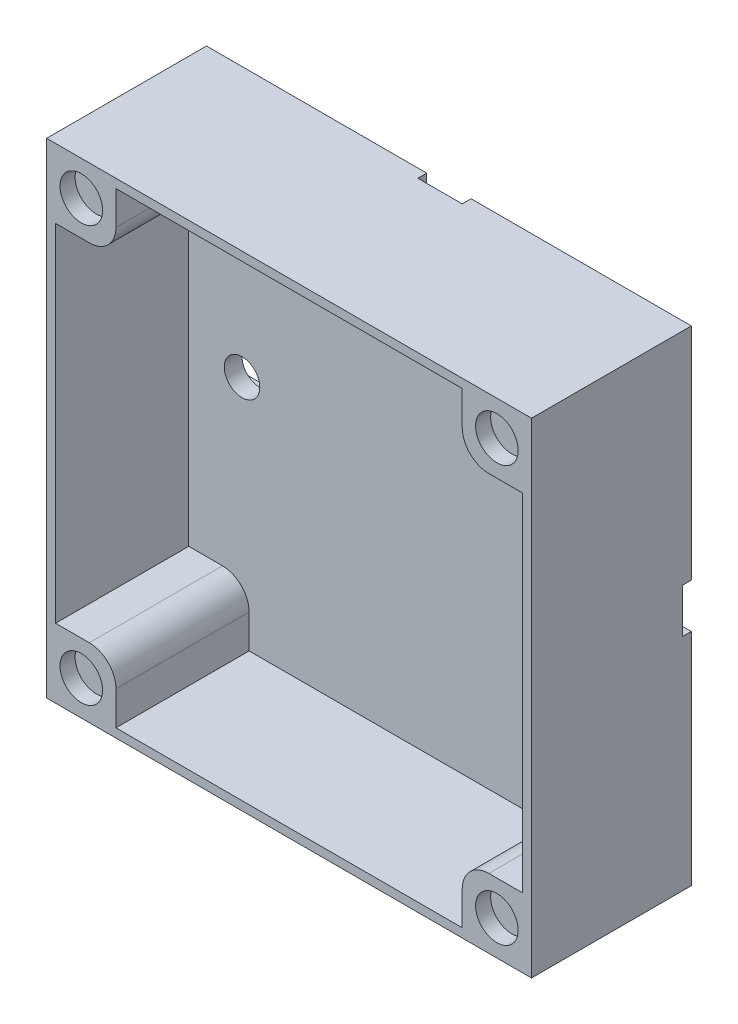
ISO-10303-21;
HEADER;
FILE_DESCRIPTION(('STEP AP214'),'2;1');
FILE_NAME('part.step','',(''),(''),'','','');
FILE_SCHEMA(('AUTOMOTIVE_DESIGN { 1 0 10303 214 1 1 1 1 }'));
ENDSEC;
DATA;
#1=APPLICATION_CONTEXT('core data for automotive mechanical design processes');
#2=APPLICATION_PROTOCOL_DEFINITION('international standard','automotive_design',2000,#1);
#3=PRODUCT_CONTEXT('',#1,'mechanical');
#4=PRODUCT('Part','Part','',(#3));
#5=PRODUCT_RELATED_PRODUCT_CATEGORY('part','',(#4));
#6=PRODUCT_DEFINITION_FORMATION('','',#4);
#7=PRODUCT_DEFINITION_CONTEXT('part definition',#1,'design');
#8=PRODUCT_DEFINITION('design','',#6,#7);
#9=PRODUCT_DEFINITION_SHAPE('','',#8);
#10=(LENGTH_UNIT() NAMED_UNIT(*) SI_UNIT(.MILLI.,.METRE.));
#11=(NAMED_UNIT(*) PLANE_ANGLE_UNIT() SI_UNIT($,.RADIAN.));
#12=(NAMED_UNIT(*) SI_UNIT($,.STERADIAN.) SOLID_ANGLE_UNIT());
#13=UNCERTAINTY_MEASURE_WITH_UNIT(LENGTH_MEASURE(1.E-05),#10,'distance_accuracy_value','');
#14=(GEOMETRIC_REPRESENTATION_CONTEXT(3) GLOBAL_UNCERTAINTY_ASSIGNED_CONTEXT((#13)) GLOBAL_UNIT_ASSIGNED_CONTEXT((#10,
#11,#12)) REPRESENTATION_CONTEXT('',''));
#15=CARTESIAN_POINT('',(0.,0.,0.));
#16=DIRECTION('',(0.,0.,1.));
#17=DIRECTION('',(1.,0.,0.));
#18=AXIS2_PLACEMENT_3D('',#15,#16,#17);
#19=CARTESIAN_POINT('',(27.3,27.3,3.));
#20=DIRECTION('',(0.,-1.,0.));
#21=DIRECTION('',(1.,0.,0.));
#22=AXIS2_PLACEMENT_3D('',#19,#20,#21);
#23=PLANE('',#22);
#24=DIRECTION('',(-1.,0.,0.));
#25=VECTOR('',#24,1.);
#26=CARTESIAN_POINT('',(27.3,27.3,0.));
#27=LINE('',#26,#25);
#28=CARTESIAN_POINT('',(-2.5,27.3,0.));
#29=VERTEX_POINT('',#28);
#30=CARTESIAN_POINT('',(-27.3,27.3,0.));
#31=VERTEX_POINT('',#30);
#32=EDGE_CURVE('E416',#29,#31,#27,.T.);
#33=ORIENTED_EDGE('',*,*,#32,.T.);
#34=DIRECTION('',(0.,0.,-1.));
#35=VECTOR('',#34,1.);
#36=CARTESIAN_POINT('',(-27.3,27.3,3.));
#37=LINE('',#36,#35);
#38=CARTESIAN_POINT('',(-27.3,27.3,18.));
#39=VERTEX_POINT('',#38);
#40=EDGE_CURVE('E429',#39,#31,#37,.T.);
#41=ORIENTED_EDGE('',*,*,#40,.F.);
#42=DIRECTION('',(-1.,0.,0.));
#43=VECTOR('',#42,1.);
#44=CARTESIAN_POINT('',(0.,27.3,18.));
#45=LINE('',#44,#43);
#46=CARTESIAN_POINT('',(27.3,27.3,18.));
#47=VERTEX_POINT('',#46);
#48=EDGE_CURVE('E341',#47,#39,#45,.T.);
#49=ORIENTED_EDGE('',*,*,#48,.F.);
#50=DIRECTION('',(0.,0.,-1.));
#51=VECTOR('',#50,1.);
#52=CARTESIAN_POINT('',(27.3,27.3,3.));
#53=LINE('',#52,#51);
#54=CARTESIAN_POINT('',(27.3,27.3,0.));
#55=VERTEX_POINT('',#54);
#56=EDGE_CURVE('E427',#47,#55,#53,.T.);
#57=ORIENTED_EDGE('',*,*,#56,.T.);
#58=CARTESIAN_POINT('',(2.5,27.3,0.));
#59=VERTEX_POINT('',#58);
#60=EDGE_CURVE('E417',#55,#59,#27,.T.);
#61=ORIENTED_EDGE('',*,*,#60,.T.);
#62=DIRECTION('',(0.,0.,-1.));
#63=VECTOR('',#62,1.);
#64=CARTESIAN_POINT('',(2.5,27.3,1.));
#65=LINE('',#64,#63);
#66=CARTESIAN_POINT('',(2.5,27.3,1.));
#67=VERTEX_POINT('',#66);
#68=EDGE_CURVE('E375',#67,#59,#65,.T.);
#69=ORIENTED_EDGE('',*,*,#68,.F.);
#70=DIRECTION('',(1.,0.,0.));
#71=VECTOR('',#70,1.);
#72=CARTESIAN_POINT('',(-2.5,27.3,1.));
#73=LINE('',#72,#71);
#74=CARTESIAN_POINT('',(-2.5,27.3,1.));
#75=VERTEX_POINT('',#74);
#76=EDGE_CURVE('E392',#75,#67,#73,.T.);
#77=ORIENTED_EDGE('',*,*,#76,.F.);
#78=DIRECTION('',(0.,0.,-1.));
#79=VECTOR('',#78,1.);
#80=CARTESIAN_POINT('',(-2.5,27.3,1.));
#81=LINE('',#80,#79);
#82=EDGE_CURVE('E399',#75,#29,#81,.T.);
#83=ORIENTED_EDGE('',*,*,#82,.T.);
#84=EDGE_LOOP('',(#33,#41,#49,#57,#61,#69,#77,#83));
#85=FACE_BOUND('',#84,.T.);
#86=ADVANCED_FACE('F71',(#85),#23,.F.);
#87=CARTESIAN_POINT('',(0.,0.,0.));
#88=DIRECTION('',(0.,0.,1.));
#89=DIRECTION('',(1.,0.,0.));
#90=AXIS2_PLACEMENT_3D('',#87,#88,#89);
#91=PLANE('',#90);
#92=DIRECTION('',(-1.,0.,0.));
#93=VECTOR('',#92,1.);
#94=CARTESIAN_POINT('',(27.3,2.5,0.));
#95=LINE('',#94,#93);
#96=CARTESIAN_POINT('',(-2.5,2.5,0.));
#97=VERTEX_POINT('',#96);
#98=CARTESIAN_POINT('',(-27.3,2.5,0.));
#99=VERTEX_POINT('',#98);
#100=EDGE_CURVE('E374',#97,#99,#95,.T.);
#101=ORIENTED_EDGE('',*,*,#100,.T.);
#102=DIRECTION('',(0.,-1.,0.));
#103=VECTOR('',#102,1.);
#104=CARTESIAN_POINT('',(-27.3,27.3,0.));
#105=LINE('',#104,#103);
#106=EDGE_CURVE('E414',#31,#99,#105,.T.);
#107=ORIENTED_EDGE('',*,*,#106,.F.);
#108=ORIENTED_EDGE('',*,*,#32,.F.);
#109=DIRECTION('',(0.,-1.,0.));
#110=VECTOR('',#109,1.);
#111=CARTESIAN_POINT('',(-2.5,27.3,0.));
#112=LINE('',#111,#110);
#113=EDGE_CURVE('E393',#29,#97,#112,.T.);
#114=ORIENTED_EDGE('',*,*,#113,.T.);
#115=EDGE_LOOP('',(#101,#107,#108,#114));
#116=FACE_BOUND('',#115,.T.);
#117=ADVANCED_FACE('F553',(#116),#91,.F.);
#118=DIRECTION('',(0.,-1.,0.));
#119=VECTOR('',#118,1.);
#120=CARTESIAN_POINT('',(2.5,27.3,0.));
#121=LINE('',#120,#119);
#122=CARTESIAN_POINT('',(2.5,2.5,0.));
#123=VERTEX_POINT('',#122);
#124=EDGE_CURVE('E346',#59,#123,#121,.T.);
#125=ORIENTED_EDGE('',*,*,#124,.F.);
#126=ORIENTED_EDGE('',*,*,#60,.F.);
#127=DIRECTION('',(0.,-1.,0.));
#128=VECTOR('',#127,1.);
#129=CARTESIAN_POINT('',(27.3,27.3,0.));
#130=LINE('',#129,#128);
#131=CARTESIAN_POINT('',(27.3,2.5,0.));
#132=VERTEX_POINT('',#131);
#133=EDGE_CURVE('E420',#55,#132,#130,.T.);
#134=ORIENTED_EDGE('',*,*,#133,.T.);
#135=EDGE_CURVE('E361',#132,#123,#95,.T.);
#136=ORIENTED_EDGE('',*,*,#135,.T.);
#137=EDGE_LOOP('',(#125,#126,#134,#136));
#138=FACE_BOUND('',#137,.T.);
#139=ADVANCED_FACE('F559',(#138),#91,.F.);
#140=CARTESIAN_POINT('',(27.3,-27.3,3.));
#141=DIRECTION('',(0.,-1.,0.));
#142=DIRECTION('',(1.,0.,0.));
#143=AXIS2_PLACEMENT_3D('',#140,#141,#142);
#144=PLANE('',#143);
#145=DIRECTION('',(0.,0.,-1.));
#146=VECTOR('',#145,1.);
#147=CARTESIAN_POINT('',(27.3,-27.3,3.));
#148=LINE('',#147,#146);
#149=CARTESIAN_POINT('',(27.3,-27.3,18.));
#150=VERTEX_POINT('',#149);
#151=CARTESIAN_POINT('',(27.3,-27.3,0.));
#152=VERTEX_POINT('',#151);
#153=EDGE_CURVE('E423',#150,#152,#148,.T.);
#154=ORIENTED_EDGE('',*,*,#153,.F.);
#155=DIRECTION('',(1.,0.,0.));
#156=VECTOR('',#155,1.);
#157=CARTESIAN_POINT('',(0.,-27.3,18.));
#158=LINE('',#157,#156);
#159=CARTESIAN_POINT('',(-27.3,-27.3,18.));
#160=VERTEX_POINT('',#159);
#161=EDGE_CURVE('E337',#160,#150,#158,.T.);
#162=ORIENTED_EDGE('',*,*,#161,.F.);
#163=DIRECTION('',(0.,0.,-1.));
#164=VECTOR('',#163,1.);
#165=CARTESIAN_POINT('',(-27.3,-27.3,3.));
#166=LINE('',#165,#164);
#167=CARTESIAN_POINT('',(-27.3,-27.3,0.));
#168=VERTEX_POINT('',#167);
#169=EDGE_CURVE('E422',#160,#168,#166,.T.);
#170=ORIENTED_EDGE('',*,*,#169,.T.);
#171=DIRECTION('',(-1.,0.,0.));
#172=VECTOR('',#171,1.);
#173=CARTESIAN_POINT('',(27.3,-27.3,0.));
#174=LINE('',#173,#172);
#175=EDGE_CURVE('E411',#152,#168,#174,.T.);
#176=ORIENTED_EDGE('',*,*,#175,.F.);
#177=EDGE_LOOP('',(#154,#162,#170,#176));
#178=FACE_BOUND('',#177,.T.);
#179=ADVANCED_FACE('F570',(#178),#144,.T.);
#180=CARTESIAN_POINT('',(27.3,27.3,3.));
#181=DIRECTION('',(1.,0.,0.));
#182=DIRECTION('',(0.,1.,0.));
#183=AXIS2_PLACEMENT_3D('',#180,#181,#182);
#184=PLANE('',#183);
#185=ORIENTED_EDGE('',*,*,#56,.F.);
#186=DIRECTION('',(0.,1.,0.));
#187=VECTOR('',#186,1.);
#188=CARTESIAN_POINT('',(27.3,0.,18.));
#189=LINE('',#188,#187);
#190=EDGE_CURVE('E339',#150,#47,#189,.T.);
#191=ORIENTED_EDGE('',*,*,#190,.F.);
#192=ORIENTED_EDGE('',*,*,#153,.T.);
#193=CARTESIAN_POINT('',(27.3,-2.5,0.));
#194=VERTEX_POINT('',#193);
#195=EDGE_CURVE('E419',#194,#152,#130,.T.);
#196=ORIENTED_EDGE('',*,*,#195,.F.);
#197=DIRECTION('',(0.,0.,-1.));
#198=VECTOR('',#197,1.);
#199=CARTESIAN_POINT('',(27.3,-2.5,1.));
#200=LINE('',#199,#198);
#201=CARTESIAN_POINT('',(27.3,-2.5,1.));
#202=VERTEX_POINT('',#201);
#203=EDGE_CURVE('E371',#202,#194,#200,.T.);
#204=ORIENTED_EDGE('',*,*,#203,.F.);
#205=DIRECTION('',(0.,-1.,0.));
#206=VECTOR('',#205,1.);
#207=CARTESIAN_POINT('',(27.3,2.5,1.));
#208=LINE('',#207,#206);
#209=CARTESIAN_POINT('',(27.3,2.5,1.));
#210=VERTEX_POINT('',#209);
#211=EDGE_CURVE('E357',#210,#202,#208,.T.);
#212=ORIENTED_EDGE('',*,*,#211,.F.);
#213=DIRECTION('',(0.,0.,-1.));
#214=VECTOR('',#213,1.);
#215=CARTESIAN_POINT('',(27.3,2.5,1.));
#216=LINE('',#215,#214);
#217=EDGE_CURVE('E378',#210,#132,#216,.T.);
#218=ORIENTED_EDGE('',*,*,#217,.T.);
#219=ORIENTED_EDGE('',*,*,#133,.F.);
#220=EDGE_LOOP('',(#185,#191,#192,#196,#204,#212,#218,#219));
#221=FACE_BOUND('',#220,.T.);
#222=ADVANCED_FACE('F565',(#221),#184,.T.);
#223=CARTESIAN_POINT('',(-27.3,27.3,3.));
#224=DIRECTION('',(1.,0.,0.));
#225=DIRECTION('',(0.,1.,0.));
#226=AXIS2_PLACEMENT_3D('',#223,#224,#225);
#227=PLANE('',#226);
#228=CARTESIAN_POINT('',(-27.3,-2.5,0.));
#229=VERTEX_POINT('',#228);
#230=EDGE_CURVE('E413',#229,#168,#105,.T.);
#231=ORIENTED_EDGE('',*,*,#230,.T.);
#232=ORIENTED_EDGE('',*,*,#169,.F.);
#233=DIRECTION('',(0.,-1.,0.));
#234=VECTOR('',#233,1.);
#235=CARTESIAN_POINT('',(-27.3,0.,18.));
#236=LINE('',#235,#234);
#237=EDGE_CURVE('E343',#39,#160,#236,.T.);
#238=ORIENTED_EDGE('',*,*,#237,.F.);
#239=ORIENTED_EDGE('',*,*,#40,.T.);
#240=ORIENTED_EDGE('',*,*,#106,.T.);
#241=DIRECTION('',(0.,0.,-1.));
#242=VECTOR('',#241,1.);
#243=CARTESIAN_POINT('',(-27.3,2.5,1.));
#244=LINE('',#243,#242);
#245=CARTESIAN_POINT('',(-27.3,2.5,1.));
#246=VERTEX_POINT('',#245);
#247=EDGE_CURVE('E382',#246,#99,#244,.T.);
#248=ORIENTED_EDGE('',*,*,#247,.F.);
#249=DIRECTION('',(0.,-1.,0.));
#250=VECTOR('',#249,1.);
#251=CARTESIAN_POINT('',(-27.3,2.5,1.));
#252=LINE('',#251,#250);
#253=CARTESIAN_POINT('',(-27.3,-2.5,1.));
#254=VERTEX_POINT('',#253);
#255=EDGE_CURVE('E364',#246,#254,#252,.T.);
#256=ORIENTED_EDGE('',*,*,#255,.T.);
#257=DIRECTION('',(0.,0.,-1.));
#258=VECTOR('',#257,1.);
#259=CARTESIAN_POINT('',(-27.3,-2.5,1.));
#260=LINE('',#259,#258);
#261=EDGE_CURVE('E385',#254,#229,#260,.T.);
#262=ORIENTED_EDGE('',*,*,#261,.T.);
#263=EDGE_LOOP('',(#231,#232,#238,#239,#240,#248,#256,#262));
#264=FACE_BOUND('',#263,.T.);
#265=ADVANCED_FACE('F566',(#264),#227,.F.);
#266=ORIENTED_EDGE('',*,*,#175,.T.);
#267=ORIENTED_EDGE('',*,*,#230,.F.);
#268=DIRECTION('',(-1.,0.,0.));
#269=VECTOR('',#268,1.);
#270=CARTESIAN_POINT('',(27.3,-2.5,0.));
#271=LINE('',#270,#269);
#272=EDGE_CURVE('E372',#194,#229,#271,.T.);
#273=ORIENTED_EDGE('',*,*,#272,.F.);
#274=ORIENTED_EDGE('',*,*,#195,.T.);
#275=EDGE_LOOP('',(#266,#267,#273,#274));
#276=FACE_BOUND('',#275,.T.);
#277=ADVANCED_FACE('F562',(#276),#91,.F.);
#278=CARTESIAN_POINT('',(27.3,-2.5,1.));
#279=DIRECTION('',(0.,-1.,0.));
#280=DIRECTION('',(0.,0.,-1.));
#281=AXIS2_PLACEMENT_3D('',#278,#279,#280);
#282=PLANE('',#281);
#283=ORIENTED_EDGE('',*,*,#272,.T.);
#284=ORIENTED_EDGE('',*,*,#261,.F.);
#285=DIRECTION('',(-1.,0.,0.));
#286=VECTOR('',#285,1.);
#287=CARTESIAN_POINT('',(27.3,-2.5,1.));
#288=LINE('',#287,#286);
#289=EDGE_CURVE('E360',#202,#254,#288,.T.);
#290=ORIENTED_EDGE('',*,*,#289,.F.);
#291=ORIENTED_EDGE('',*,*,#203,.T.);
#292=EDGE_LOOP('',(#283,#284,#290,#291));
#293=FACE_BOUND('',#292,.T.);
#294=ADVANCED_FACE('F649',(#293),#282,.F.);
#295=CARTESIAN_POINT('',(0.,0.,1.));
#296=DIRECTION('',(0.,0.,-1.));
#297=DIRECTION('',(-1.,0.,0.));
#298=AXIS2_PLACEMENT_3D('',#295,#296,#297);
#299=PLANE('',#298);
#300=CARTESIAN_POINT('',(0.,20.3,1.));
#301=DIRECTION('',(0.,0.,-1.));
#302=DIRECTION('',(-1.,0.,0.));
#303=AXIS2_PLACEMENT_3D('',#300,#301,#302);
#304=CIRCLE('',#303,2.);
#305=CARTESIAN_POINT('',(-2.,20.3,1.));
#306=VERTEX_POINT('',#305);
#307=EDGE_CURVE('E323',#306,#306,#304,.T.);
#308=ORIENTED_EDGE('',*,*,#307,.F.);
#309=EDGE_LOOP('',(#308));
#310=FACE_BOUND('',#309,.T.);
#311=CARTESIAN_POINT('',(-20.3,0.,1.));
#312=DIRECTION('',(0.,0.,-1.));
#313=DIRECTION('',(-1.,0.,0.));
#314=AXIS2_PLACEMENT_3D('',#311,#312,#313);
#315=CIRCLE('',#314,2.);
#316=CARTESIAN_POINT('',(-22.3,0.,1.));
#317=VERTEX_POINT('',#316);
#318=EDGE_CURVE('E327',#317,#317,#315,.T.);
#319=ORIENTED_EDGE('',*,*,#318,.F.);
#320=EDGE_LOOP('',(#319));
#321=FACE_BOUND('',#320,.T.);
#322=CARTESIAN_POINT('',(20.3,0.,1.));
#323=DIRECTION('',(0.,0.,-1.));
#324=DIRECTION('',(-1.,0.,0.));
#325=AXIS2_PLACEMENT_3D('',#322,#323,#324);
#326=CIRCLE('',#325,2.);
#327=CARTESIAN_POINT('',(18.3,0.,1.));
#328=VERTEX_POINT('',#327);
#329=EDGE_CURVE('E322',#328,#328,#326,.T.);
#330=ORIENTED_EDGE('',*,*,#329,.F.);
#331=EDGE_LOOP('',(#330));
#332=FACE_BOUND('',#331,.T.);
#333=ORIENTED_EDGE('',*,*,#211,.T.);
#334=ORIENTED_EDGE('',*,*,#289,.T.);
#335=ORIENTED_EDGE('',*,*,#255,.F.);
#336=DIRECTION('',(-1.,0.,0.));
#337=VECTOR('',#336,1.);
#338=CARTESIAN_POINT('',(27.3,2.5,1.));
#339=LINE('',#338,#337);
#340=CARTESIAN_POINT('',(-2.5,2.5,1.));
#341=VERTEX_POINT('',#340);
#342=EDGE_CURVE('E367',#341,#246,#339,.T.);
#343=ORIENTED_EDGE('',*,*,#342,.F.);
#344=DIRECTION('',(0.,-1.,0.));
#345=VECTOR('',#344,1.);
#346=CARTESIAN_POINT('',(-2.5,27.3,1.));
#347=LINE('',#346,#345);
#348=EDGE_CURVE('E396',#75,#341,#347,.T.);
#349=ORIENTED_EDGE('',*,*,#348,.F.);
#350=ORIENTED_EDGE('',*,*,#76,.T.);
#351=DIRECTION('',(0.,-1.,0.));
#352=VECTOR('',#351,1.);
#353=CARTESIAN_POINT('',(2.5,27.3,1.));
#354=LINE('',#353,#352);
#355=CARTESIAN_POINT('',(2.5,2.5,1.));
#356=VERTEX_POINT('',#355);
#357=EDGE_CURVE('E389',#67,#356,#354,.T.);
#358=ORIENTED_EDGE('',*,*,#357,.T.);
#359=EDGE_CURVE('E368',#210,#356,#339,.T.);
#360=ORIENTED_EDGE('',*,*,#359,.F.);
#361=EDGE_LOOP('',(#333,#334,#335,#343,#349,#350,#358,#360));
#362=FACE_BOUND('',#361,.T.);
#363=ADVANCED_FACE('F655',(#310,#321,#332,#362),#299,.T.);
#364=CARTESIAN_POINT('',(27.3,2.5,1.));
#365=DIRECTION('',(0.,-1.,0.));
#366=DIRECTION('',(0.,0.,-1.));
#367=AXIS2_PLACEMENT_3D('',#364,#365,#366);
#368=PLANE('',#367);
#369=ORIENTED_EDGE('',*,*,#342,.T.);
#370=ORIENTED_EDGE('',*,*,#247,.T.);
#371=ORIENTED_EDGE('',*,*,#100,.F.);
#372=DIRECTION('',(0.,0.,-1.));
#373=VECTOR('',#372,1.);
#374=CARTESIAN_POINT('',(-2.5,2.50000000000001,1.));
#375=LINE('',#374,#373);
#376=EDGE_CURVE('E381',#341,#97,#375,.T.);
#377=ORIENTED_EDGE('',*,*,#376,.F.);
#378=EDGE_LOOP('',(#369,#370,#371,#377));
#379=FACE_BOUND('',#378,.T.);
#380=ADVANCED_FACE('F645',(#379),#368,.T.);
#381=DIRECTION('',(0.,0.,-1.));
#382=VECTOR('',#381,1.);
#383=CARTESIAN_POINT('',(2.5,2.50000000000001,1.));
#384=LINE('',#383,#382);
#385=EDGE_CURVE('E405',#356,#123,#384,.T.);
#386=ORIENTED_EDGE('',*,*,#385,.T.);
#387=ORIENTED_EDGE('',*,*,#135,.F.);
#388=ORIENTED_EDGE('',*,*,#217,.F.);
#389=ORIENTED_EDGE('',*,*,#359,.T.);
#390=EDGE_LOOP('',(#386,#387,#388,#389));
#391=FACE_BOUND('',#390,.T.);
#392=ADVANCED_FACE('F636',(#391),#368,.T.);
#393=CARTESIAN_POINT('',(-2.5,27.3,1.));
#394=DIRECTION('',(1.,0.,0.));
#395=DIRECTION('',(0.,1.,0.));
#396=AXIS2_PLACEMENT_3D('',#393,#394,#395);
#397=PLANE('',#396);
#398=ORIENTED_EDGE('',*,*,#113,.F.);
#399=ORIENTED_EDGE('',*,*,#82,.F.);
#400=ORIENTED_EDGE('',*,*,#348,.T.);
#401=ORIENTED_EDGE('',*,*,#376,.T.);
#402=EDGE_LOOP('',(#398,#399,#400,#401));
#403=FACE_BOUND('',#402,.T.);
#404=ADVANCED_FACE('F624',(#403),#397,.T.);
#405=CARTESIAN_POINT('',(2.5,27.3,1.));
#406=DIRECTION('',(1.,0.,0.));
#407=DIRECTION('',(0.,1.,0.));
#408=AXIS2_PLACEMENT_3D('',#405,#406,#407);
#409=PLANE('',#408);
#410=ORIENTED_EDGE('',*,*,#124,.T.);
#411=ORIENTED_EDGE('',*,*,#385,.F.);
#412=ORIENTED_EDGE('',*,*,#357,.F.);
#413=ORIENTED_EDGE('',*,*,#68,.T.);
#414=EDGE_LOOP('',(#410,#411,#412,#413));
#415=FACE_BOUND('',#414,.T.);
#416=ADVANCED_FACE('F633',(#415),#409,.F.);
#417=CARTESIAN_POINT('',(26.3,0.,18.));
#418=DIRECTION('',(1.,0.,0.));
#419=DIRECTION('',(0.,1.,0.));
#420=AXIS2_PLACEMENT_3D('',#417,#418,#419);
#421=PLANE('',#420);
#422=DIRECTION('',(0.,-1.,0.));
#423=VECTOR('',#422,1.);
#424=CARTESIAN_POINT('',(26.3,0.,3.));
#425=LINE('',#424,#423);
#426=CARTESIAN_POINT('',(26.3,19.5,3.));
#427=VERTEX_POINT('',#426);
#428=CARTESIAN_POINT('',(26.3,-19.5,3.));
#429=VERTEX_POINT('',#428);
#430=EDGE_CURVE('E276',#427,#429,#425,.T.);
#431=ORIENTED_EDGE('',*,*,#430,.T.);
#432=DIRECTION('',(0.,0.,1.));
#433=VECTOR('',#432,1.);
#434=CARTESIAN_POINT('',(26.3,-19.5,18.));
#435=LINE('',#434,#433);
#436=CARTESIAN_POINT('',(26.3,-19.5,18.));
#437=VERTEX_POINT('',#436);
#438=EDGE_CURVE('E298',#429,#437,#435,.T.);
#439=ORIENTED_EDGE('',*,*,#438,.T.);
#440=DIRECTION('',(0.,-1.,0.));
#441=VECTOR('',#440,1.);
#442=CARTESIAN_POINT('',(26.3,0.,18.));
#443=LINE('',#442,#441);
#444=CARTESIAN_POINT('',(26.3,19.5,18.));
#445=VERTEX_POINT('',#444);
#446=EDGE_CURVE('E334',#445,#437,#443,.T.);
#447=ORIENTED_EDGE('',*,*,#446,.F.);
#448=DIRECTION('',(0.,0.,-1.));
#449=VECTOR('',#448,1.);
#450=CARTESIAN_POINT('',(26.3,19.5,18.));
#451=LINE('',#450,#449);
#452=EDGE_CURVE('E316',#445,#427,#451,.T.);
#453=ORIENTED_EDGE('',*,*,#452,.T.);
#454=EDGE_LOOP('',(#431,#439,#447,#453));
#455=FACE_BOUND('',#454,.T.);
#456=ADVANCED_FACE('F610',(#455),#421,.F.);
#457=CARTESIAN_POINT('',(-26.3,0.,18.));
#458=DIRECTION('',(1.,0.,0.));
#459=DIRECTION('',(0.,1.,0.));
#460=AXIS2_PLACEMENT_3D('',#457,#458,#459);
#461=PLANE('',#460);
#462=DIRECTION('',(0.,0.,1.));
#463=VECTOR('',#462,1.);
#464=CARTESIAN_POINT('',(-26.3,-19.5,18.));
#465=LINE('',#464,#463);
#466=CARTESIAN_POINT('',(-26.3,-19.5,3.));
#467=VERTEX_POINT('',#466);
#468=CARTESIAN_POINT('',(-26.3,-19.5,18.));
#469=VERTEX_POINT('',#468);
#470=EDGE_CURVE('E260',#467,#469,#465,.T.);
#471=ORIENTED_EDGE('',*,*,#470,.F.);
#472=DIRECTION('',(0.,-1.,0.));
#473=VECTOR('',#472,1.);
#474=CARTESIAN_POINT('',(-26.3,0.,3.));
#475=LINE('',#474,#473);
#476=CARTESIAN_POINT('',(-26.3,19.5,3.));
#477=VERTEX_POINT('',#476);
#478=EDGE_CURVE('E268',#477,#467,#475,.T.);
#479=ORIENTED_EDGE('',*,*,#478,.F.);
#480=DIRECTION('',(0.,0.,-1.));
#481=VECTOR('',#480,1.);
#482=CARTESIAN_POINT('',(-26.3,19.5,18.));
#483=LINE('',#482,#481);
#484=CARTESIAN_POINT('',(-26.3,19.5,18.));
#485=VERTEX_POINT('',#484);
#486=EDGE_CURVE('E309',#485,#477,#483,.T.);
#487=ORIENTED_EDGE('',*,*,#486,.F.);
#488=DIRECTION('',(0.,-1.,0.));
#489=VECTOR('',#488,1.);
#490=CARTESIAN_POINT('',(-26.3,0.,18.));
#491=LINE('',#490,#489);
#492=EDGE_CURVE('E280',#485,#469,#491,.T.);
#493=ORIENTED_EDGE('',*,*,#492,.T.);
#494=EDGE_LOOP('',(#471,#479,#487,#493));
#495=FACE_BOUND('',#494,.T.);
#496=ADVANCED_FACE('F278',(#495),#461,.T.);
#497=CARTESIAN_POINT('',(0.,26.3,18.));
#498=DIRECTION('',(0.,1.,0.));
#499=DIRECTION('',(0.,0.,1.));
#500=AXIS2_PLACEMENT_3D('',#497,#498,#499);
#501=PLANE('',#500);
#502=DIRECTION('',(1.,0.,0.));
#503=VECTOR('',#502,1.);
#504=CARTESIAN_POINT('',(0.,26.3,18.));
#505=LINE('',#504,#503);
#506=CARTESIAN_POINT('',(-19.5,26.3,18.));
#507=VERTEX_POINT('',#506);
#508=CARTESIAN_POINT('',(19.5,26.3,18.));
#509=VERTEX_POINT('',#508);
#510=EDGE_CURVE('E275',#507,#509,#505,.T.);
#511=ORIENTED_EDGE('',*,*,#510,.F.);
#512=DIRECTION('',(0.,0.,-1.));
#513=VECTOR('',#512,1.);
#514=CARTESIAN_POINT('',(-19.5,26.3,18.));
#515=LINE('',#514,#513);
#516=CARTESIAN_POINT('',(-19.5,26.3,3.));
#517=VERTEX_POINT('',#516);
#518=EDGE_CURVE('E306',#507,#517,#515,.T.);
#519=ORIENTED_EDGE('',*,*,#518,.T.);
#520=DIRECTION('',(1.,0.,0.));
#521=VECTOR('',#520,1.);
#522=CARTESIAN_POINT('',(0.,26.3,3.));
#523=LINE('',#522,#521);
#524=CARTESIAN_POINT('',(19.5,26.3,3.));
#525=VERTEX_POINT('',#524);
#526=EDGE_CURVE('E347',#517,#525,#523,.T.);
#527=ORIENTED_EDGE('',*,*,#526,.T.);
#528=DIRECTION('',(0.,0.,1.));
#529=VECTOR('',#528,1.);
#530=CARTESIAN_POINT('',(19.5,26.3,18.));
#531=LINE('',#530,#529);
#532=EDGE_CURVE('E319',#525,#509,#531,.T.);
#533=ORIENTED_EDGE('',*,*,#532,.T.);
#534=EDGE_LOOP('',(#511,#519,#527,#533));
#535=FACE_BOUND('',#534,.T.);
#536=ADVANCED_FACE('F534',(#535),#501,.F.);
#537=CARTESIAN_POINT('',(0.,0.,18.));
#538=DIRECTION('',(0.,0.,1.));
#539=DIRECTION('',(1.,0.,0.));
#540=AXIS2_PLACEMENT_3D('',#537,#538,#539);
#541=PLANE('',#540);
#542=CARTESIAN_POINT('',(23.4002805646626,-23.4,18.));
#543=DIRECTION('',(0.,0.,1.));
#544=DIRECTION('',(1.,0.,0.));
#545=AXIS2_PLACEMENT_3D('',#542,#543,#544);
#546=CIRCLE('',#545,2.4);
#547=CARTESIAN_POINT('',(25.8002805646626,-23.4,18.));
#548=VERTEX_POINT('',#547);
#549=EDGE_CURVE('E504',#548,#548,#546,.T.);
#550=ORIENTED_EDGE('',*,*,#549,.F.);
#551=EDGE_LOOP('',(#550));
#552=FACE_BOUND('',#551,.T.);
#553=CARTESIAN_POINT('',(23.4002805646626,23.4,18.));
#554=DIRECTION('',(0.,0.,1.));
#555=DIRECTION('',(1.,0.,0.));
#556=AXIS2_PLACEMENT_3D('',#553,#554,#555);
#557=CIRCLE('',#556,2.4);
#558=CARTESIAN_POINT('',(25.8002805646626,23.4,18.));
#559=VERTEX_POINT('',#558);
#560=EDGE_CURVE('E510',#559,#559,#557,.T.);
#561=ORIENTED_EDGE('',*,*,#560,.F.);
#562=EDGE_LOOP('',(#561));
#563=FACE_BOUND('',#562,.T.);
#564=CARTESIAN_POINT('',(-23.4,23.4,18.));
#565=DIRECTION('',(0.,0.,1.));
#566=DIRECTION('',(1.,0.,0.));
#567=AXIS2_PLACEMENT_3D('',#564,#565,#566);
#568=CIRCLE('',#567,2.4);
#569=CARTESIAN_POINT('',(-21.,23.4,18.));
#570=VERTEX_POINT('',#569);
#571=EDGE_CURVE('E516',#570,#570,#568,.T.);
#572=ORIENTED_EDGE('',*,*,#571,.F.);
#573=EDGE_LOOP('',(#572));
#574=FACE_BOUND('',#573,.T.);
#575=CARTESIAN_POINT('',(-23.4,-23.4,18.));
#576=DIRECTION('',(0.,0.,1.));
#577=DIRECTION('',(1.,0.,0.));
#578=AXIS2_PLACEMENT_3D('',#575,#576,#577);
#579=CIRCLE('',#578,2.4);
#580=CARTESIAN_POINT('',(-21.,-23.4,18.));
#581=VERTEX_POINT('',#580);
#582=EDGE_CURVE('E498',#581,#581,#579,.T.);
#583=ORIENTED_EDGE('',*,*,#582,.F.);
#584=EDGE_LOOP('',(#583));
#585=FACE_BOUND('',#584,.T.);
#586=DIRECTION('',(0.,1.,0.));
#587=VECTOR('',#586,1.);
#588=CARTESIAN_POINT('',(19.5,27.3,18.));
#589=LINE('',#588,#587);
#590=CARTESIAN_POINT('',(19.5,22.5,18.));
#591=VERTEX_POINT('',#590);
#592=EDGE_CURVE('E314',#591,#509,#589,.T.);
#593=ORIENTED_EDGE('',*,*,#592,.F.);
#594=CARTESIAN_POINT('',(22.5,22.5,18.));
#595=DIRECTION('',(0.,0.,1.));
#596=DIRECTION('',(1.,0.,0.));
#597=AXIS2_PLACEMENT_3D('',#594,#595,#596);
#598=CIRCLE('',#597,3.);
#599=CARTESIAN_POINT('',(22.5,19.5,18.));
#600=VERTEX_POINT('',#599);
#601=EDGE_CURVE('E465',#591,#600,#598,.T.);
#602=ORIENTED_EDGE('',*,*,#601,.T.);
#603=DIRECTION('',(-1.,0.,0.));
#604=VECTOR('',#603,1.);
#605=CARTESIAN_POINT('',(27.3,19.5,18.));
#606=LINE('',#605,#604);
#607=EDGE_CURVE('E311',#445,#600,#606,.T.);
#608=ORIENTED_EDGE('',*,*,#607,.F.);
#609=ORIENTED_EDGE('',*,*,#446,.T.);
#610=DIRECTION('',(1.,0.,0.));
#611=VECTOR('',#610,1.);
#612=CARTESIAN_POINT('',(27.3,-19.5,18.));
#613=LINE('',#612,#611);
#614=CARTESIAN_POINT('',(22.5,-19.5,18.));
#615=VERTEX_POINT('',#614);
#616=EDGE_CURVE('E293',#615,#437,#613,.T.);
#617=ORIENTED_EDGE('',*,*,#616,.F.);
#618=CARTESIAN_POINT('',(22.5,-22.5,18.));
#619=DIRECTION('',(0.,0.,1.));
#620=DIRECTION('',(1.,0.,0.));
#621=AXIS2_PLACEMENT_3D('',#618,#619,#620);
#622=CIRCLE('',#621,3.);
#623=CARTESIAN_POINT('',(19.5,-22.5,18.));
#624=VERTEX_POINT('',#623);
#625=EDGE_CURVE('E463',#615,#624,#622,.T.);
#626=ORIENTED_EDGE('',*,*,#625,.T.);
#627=DIRECTION('',(0.,1.,0.));
#628=VECTOR('',#627,1.);
#629=CARTESIAN_POINT('',(19.5,-27.3,18.));
#630=LINE('',#629,#628);
#631=CARTESIAN_POINT('',(19.5,-26.3,18.));
#632=VERTEX_POINT('',#631);
#633=EDGE_CURVE('E285',#632,#624,#630,.T.);
#634=ORIENTED_EDGE('',*,*,#633,.F.);
#635=DIRECTION('',(1.,0.,0.));
#636=VECTOR('',#635,1.);
#637=CARTESIAN_POINT('',(-26.3,-26.3,18.));
#638=LINE('',#637,#636);
#639=CARTESIAN_POINT('',(-19.5,-26.3,18.));
#640=VERTEX_POINT('',#639);
#641=EDGE_CURVE('E349',#640,#632,#638,.T.);
#642=ORIENTED_EDGE('',*,*,#641,.F.);
#643=DIRECTION('',(0.,-1.,0.));
#644=VECTOR('',#643,1.);
#645=CARTESIAN_POINT('',(-19.5,-27.3,18.));
#646=LINE('',#645,#644);
#647=CARTESIAN_POINT('',(-19.5,-22.5,18.));
#648=VERTEX_POINT('',#647);
#649=EDGE_CURVE('E282',#648,#640,#646,.T.);
#650=ORIENTED_EDGE('',*,*,#649,.F.);
#651=CARTESIAN_POINT('',(-22.5,-22.5,18.));
#652=DIRECTION('',(0.,0.,1.));
#653=DIRECTION('',(1.,0.,0.));
#654=AXIS2_PLACEMENT_3D('',#651,#652,#653);
#655=CIRCLE('',#654,3.);
#656=CARTESIAN_POINT('',(-22.5,-19.5,18.));
#657=VERTEX_POINT('',#656);
#658=EDGE_CURVE('E461',#648,#657,#655,.T.);
#659=ORIENTED_EDGE('',*,*,#658,.T.);
#660=DIRECTION('',(1.,0.,0.));
#661=VECTOR('',#660,1.);
#662=CARTESIAN_POINT('',(-27.3,-19.5,18.));
#663=LINE('',#662,#661);
#664=EDGE_CURVE('E287',#469,#657,#663,.T.);
#665=ORIENTED_EDGE('',*,*,#664,.F.);
#666=ORIENTED_EDGE('',*,*,#492,.F.);
#667=DIRECTION('',(-1.,0.,0.));
#668=VECTOR('',#667,1.);
#669=CARTESIAN_POINT('',(-27.3,19.5,18.));
#670=LINE('',#669,#668);
#671=CARTESIAN_POINT('',(-22.5,19.5,18.));
#672=VERTEX_POINT('',#671);
#673=EDGE_CURVE('E304',#672,#485,#670,.T.);
#674=ORIENTED_EDGE('',*,*,#673,.F.);
#675=CARTESIAN_POINT('',(-22.5,22.5,18.));
#676=DIRECTION('',(0.,0.,1.));
#677=DIRECTION('',(1.,0.,0.));
#678=AXIS2_PLACEMENT_3D('',#675,#676,#677);
#679=CIRCLE('',#678,3.);
#680=CARTESIAN_POINT('',(-19.5,22.5,18.));
#681=VERTEX_POINT('',#680);
#682=EDGE_CURVE('E459',#672,#681,#679,.T.);
#683=ORIENTED_EDGE('',*,*,#682,.T.);
#684=DIRECTION('',(0.,-1.,0.));
#685=VECTOR('',#684,1.);
#686=CARTESIAN_POINT('',(-19.5,27.3,18.));
#687=LINE('',#686,#685);
#688=EDGE_CURVE('E301',#507,#681,#687,.T.);
#689=ORIENTED_EDGE('',*,*,#688,.F.);
#690=ORIENTED_EDGE('',*,*,#510,.T.);
#691=EDGE_LOOP('',(#593,#602,#608,#609,#617,#626,#634,#642,#650,#659,#665,#666,#674,#683,#689,#690));
#692=FACE_BOUND('',#691,.T.);
#693=ORIENTED_EDGE('',*,*,#161,.T.);
#694=ORIENTED_EDGE('',*,*,#190,.T.);
#695=ORIENTED_EDGE('',*,*,#48,.T.);
#696=ORIENTED_EDGE('',*,*,#237,.T.);
#697=EDGE_LOOP('',(#693,#694,#695,#696));
#698=FACE_BOUND('',#697,.T.);
#699=ADVANCED_FACE('F493',(#552,#563,#574,#585,#692,#698),#541,.T.);
#700=CARTESIAN_POINT('',(-26.3,-26.3,18.));
#701=DIRECTION('',(0.,1.,0.));
#702=DIRECTION('',(0.,0.,1.));
#703=AXIS2_PLACEMENT_3D('',#700,#701,#702);
#704=PLANE('',#703);
#705=DIRECTION('',(0.,0.,-1.));
#706=VECTOR('',#705,1.);
#707=CARTESIAN_POINT('',(-19.5,-26.3,18.));
#708=LINE('',#707,#706);
#709=CARTESIAN_POINT('',(-19.5,-26.3,3.));
#710=VERTEX_POINT('',#709);
#711=EDGE_CURVE('E281',#640,#710,#708,.T.);
#712=ORIENTED_EDGE('',*,*,#711,.F.);
#713=ORIENTED_EDGE('',*,*,#641,.T.);
#714=DIRECTION('',(0.,0.,1.));
#715=VECTOR('',#714,1.);
#716=CARTESIAN_POINT('',(19.5,-26.3,18.));
#717=LINE('',#716,#715);
#718=CARTESIAN_POINT('',(19.5,-26.3,3.));
#719=VERTEX_POINT('',#718);
#720=EDGE_CURVE('E295',#719,#632,#717,.T.);
#721=ORIENTED_EDGE('',*,*,#720,.F.);
#722=DIRECTION('',(1.,0.,0.));
#723=VECTOR('',#722,1.);
#724=CARTESIAN_POINT('',(-26.3,-26.3,3.));
#725=LINE('',#724,#723);
#726=EDGE_CURVE('E353',#710,#719,#725,.T.);
#727=ORIENTED_EDGE('',*,*,#726,.F.);
#728=EDGE_LOOP('',(#712,#713,#721,#727));
#729=FACE_BOUND('',#728,.T.);
#730=ADVANCED_FACE('F533',(#729),#704,.T.);
#731=CARTESIAN_POINT('',(0.,0.,3.));
#732=DIRECTION('',(0.,0.,1.));
#733=DIRECTION('',(1.,0.,0.));
#734=AXIS2_PLACEMENT_3D('',#731,#732,#733);
#735=PLANE('',#734);
#736=DIRECTION('',(0.,1.,0.));
#737=VECTOR('',#736,1.);
#738=CARTESIAN_POINT('',(-19.5,0.,3.));
#739=LINE('',#738,#737);
#740=CARTESIAN_POINT('',(-19.5,-22.5,3.));
#741=VERTEX_POINT('',#740);
#742=EDGE_CURVE('E264',#710,#741,#739,.T.);
#743=ORIENTED_EDGE('',*,*,#742,.F.);
#744=ORIENTED_EDGE('',*,*,#726,.T.);
#745=DIRECTION('',(0.,-1.,0.));
#746=VECTOR('',#745,1.);
#747=CARTESIAN_POINT('',(19.5,0.,3.));
#748=LINE('',#747,#746);
#749=CARTESIAN_POINT('',(19.5,-22.5,3.));
#750=VERTEX_POINT('',#749);
#751=EDGE_CURVE('E448',#750,#719,#748,.T.);
#752=ORIENTED_EDGE('',*,*,#751,.F.);
#753=CARTESIAN_POINT('',(22.5,-22.5,3.));
#754=DIRECTION('',(0.,0.,1.));
#755=DIRECTION('',(1.,0.,0.));
#756=AXIS2_PLACEMENT_3D('',#753,#754,#755);
#757=CIRCLE('',#756,3.);
#758=CARTESIAN_POINT('',(22.5,-19.5,3.));
#759=VERTEX_POINT('',#758);
#760=EDGE_CURVE('E481',#750,#759,#757,.F.);
#761=ORIENTED_EDGE('',*,*,#760,.T.);
#762=DIRECTION('',(-1.,0.,0.));
#763=VECTOR('',#762,1.);
#764=CARTESIAN_POINT('',(0.,-19.5,3.));
#765=LINE('',#764,#763);
#766=EDGE_CURVE('E265',#429,#759,#765,.T.);
#767=ORIENTED_EDGE('',*,*,#766,.F.);
#768=ORIENTED_EDGE('',*,*,#430,.F.);
#769=DIRECTION('',(1.,0.,0.));
#770=VECTOR('',#769,1.);
#771=CARTESIAN_POINT('',(0.,19.5,3.));
#772=LINE('',#771,#770);
#773=CARTESIAN_POINT('',(22.5,19.5,3.));
#774=VERTEX_POINT('',#773);
#775=EDGE_CURVE('E426',#774,#427,#772,.T.);
#776=ORIENTED_EDGE('',*,*,#775,.F.);
#777=CARTESIAN_POINT('',(22.5,22.5,3.));
#778=DIRECTION('',(0.,0.,1.));
#779=DIRECTION('',(1.,0.,0.));
#780=AXIS2_PLACEMENT_3D('',#777,#778,#779);
#781=CIRCLE('',#780,3.);
#782=CARTESIAN_POINT('',(19.5,22.5,3.));
#783=VERTEX_POINT('',#782);
#784=EDGE_CURVE('E479',#774,#783,#781,.F.);
#785=ORIENTED_EDGE('',*,*,#784,.T.);
#786=DIRECTION('',(0.,-1.,0.));
#787=VECTOR('',#786,1.);
#788=CARTESIAN_POINT('',(19.5,0.,3.));
#789=LINE('',#788,#787);
#790=EDGE_CURVE('E442',#525,#783,#789,.T.);
#791=ORIENTED_EDGE('',*,*,#790,.F.);
#792=ORIENTED_EDGE('',*,*,#526,.F.);
#793=DIRECTION('',(0.,1.,0.));
#794=VECTOR('',#793,1.);
#795=CARTESIAN_POINT('',(-19.5,0.,3.));
#796=LINE('',#795,#794);
#797=CARTESIAN_POINT('',(-19.5,22.5,3.));
#798=VERTEX_POINT('',#797);
#799=EDGE_CURVE('E445',#798,#517,#796,.T.);
#800=ORIENTED_EDGE('',*,*,#799,.F.);
#801=CARTESIAN_POINT('',(-22.5,22.5,3.));
#802=DIRECTION('',(0.,0.,1.));
#803=DIRECTION('',(1.,0.,0.));
#804=AXIS2_PLACEMENT_3D('',#801,#802,#803);
#805=CIRCLE('',#804,3.);
#806=CARTESIAN_POINT('',(-22.5,19.5,3.));
#807=VERTEX_POINT('',#806);
#808=EDGE_CURVE('E12',#798,#807,#805,.F.);
#809=ORIENTED_EDGE('',*,*,#808,.T.);
#810=DIRECTION('',(1.,0.,0.));
#811=VECTOR('',#810,1.);
#812=CARTESIAN_POINT('',(0.,19.5,3.));
#813=LINE('',#812,#811);
#814=EDGE_CURVE('E271',#477,#807,#813,.T.);
#815=ORIENTED_EDGE('',*,*,#814,.F.);
#816=ORIENTED_EDGE('',*,*,#478,.T.);
#817=DIRECTION('',(-1.,0.,0.));
#818=VECTOR('',#817,1.);
#819=CARTESIAN_POINT('',(0.,-19.5,3.));
#820=LINE('',#819,#818);
#821=CARTESIAN_POINT('',(-22.5,-19.5,3.));
#822=VERTEX_POINT('',#821);
#823=EDGE_CURVE('E255',#822,#467,#820,.T.);
#824=ORIENTED_EDGE('',*,*,#823,.F.);
#825=CARTESIAN_POINT('',(-22.5,-22.5,3.));
#826=DIRECTION('',(0.,0.,1.));
#827=DIRECTION('',(1.,0.,0.));
#828=AXIS2_PLACEMENT_3D('',#825,#826,#827);
#829=CIRCLE('',#828,3.);
#830=EDGE_CURVE('E79',#822,#741,#829,.F.);
#831=ORIENTED_EDGE('',*,*,#830,.T.);
#832=EDGE_LOOP('',(#743,#744,#752,#761,#767,#768,#776,#785,#791,#792,#800,#809,#815,#816,#824,#831));
#833=FACE_BOUND('',#832,.T.);
#834=CARTESIAN_POINT('',(0.,20.3,3.));
#835=DIRECTION('',(0.,0.,1.));
#836=DIRECTION('',(1.,0.,0.));
#837=AXIS2_PLACEMENT_3D('',#834,#835,#836);
#838=CIRCLE('',#837,2.);
#839=CARTESIAN_POINT('',(2.,20.3,3.));
#840=VERTEX_POINT('',#839);
#841=EDGE_CURVE('E356',#840,#840,#838,.T.);
#842=ORIENTED_EDGE('',*,*,#841,.F.);
#843=EDGE_LOOP('',(#842));
#844=FACE_BOUND('',#843,.T.);
#845=CARTESIAN_POINT('',(-20.3,0.,3.));
#846=DIRECTION('',(0.,0.,1.));
#847=DIRECTION('',(1.,0.,0.));
#848=AXIS2_PLACEMENT_3D('',#845,#846,#847);
#849=CIRCLE('',#848,2.);
#850=CARTESIAN_POINT('',(-18.3,0.,3.));
#851=VERTEX_POINT('',#850);
#852=EDGE_CURVE('E436',#851,#851,#849,.T.);
#853=ORIENTED_EDGE('',*,*,#852,.F.);
#854=EDGE_LOOP('',(#853));
#855=FACE_BOUND('',#854,.T.);
#856=CARTESIAN_POINT('',(20.3,0.,3.));
#857=DIRECTION('',(0.,0.,1.));
#858=DIRECTION('',(1.,0.,0.));
#859=AXIS2_PLACEMENT_3D('',#856,#857,#858);
#860=CIRCLE('',#859,2.);
#861=CARTESIAN_POINT('',(22.3,0.,3.));
#862=VERTEX_POINT('',#861);
#863=EDGE_CURVE('E326',#862,#862,#860,.T.);
#864=ORIENTED_EDGE('',*,*,#863,.F.);
#865=EDGE_LOOP('',(#864));
#866=FACE_BOUND('',#865,.T.);
#867=ADVANCED_FACE('F269',(#833,#844,#855,#866),#735,.T.);
#868=CARTESIAN_POINT('',(20.3,0.,8.));
#869=DIRECTION('',(0.,0.,-1.));
#870=DIRECTION('',(-1.,0.,0.));
#871=AXIS2_PLACEMENT_3D('',#868,#869,#870);
#872=CYLINDRICAL_SURFACE('',#871,2.);
#873=ORIENTED_EDGE('',*,*,#863,.T.);
#874=EDGE_LOOP('',(#873));
#875=FACE_BOUND('',#874,.T.);
#876=ORIENTED_EDGE('',*,*,#329,.T.);
#877=EDGE_LOOP('',(#876));
#878=FACE_BOUND('',#877,.T.);
#879=ADVANCED_FACE('F628',(#875,#878),#872,.F.);
#880=CARTESIAN_POINT('',(-20.3,0.,8.));
#881=DIRECTION('',(0.,0.,-1.));
#882=DIRECTION('',(-1.,0.,0.));
#883=AXIS2_PLACEMENT_3D('',#880,#881,#882);
#884=CYLINDRICAL_SURFACE('',#883,2.);
#885=ORIENTED_EDGE('',*,*,#852,.T.);
#886=EDGE_LOOP('',(#885));
#887=FACE_BOUND('',#886,.T.);
#888=ORIENTED_EDGE('',*,*,#318,.T.);
#889=EDGE_LOOP('',(#888));
#890=FACE_BOUND('',#889,.T.);
#891=ADVANCED_FACE('F708',(#887,#890),#884,.F.);
#892=CARTESIAN_POINT('',(0.,20.3,8.));
#893=DIRECTION('',(0.,0.,-1.));
#894=DIRECTION('',(-1.,0.,0.));
#895=AXIS2_PLACEMENT_3D('',#892,#893,#894);
#896=CYLINDRICAL_SURFACE('',#895,2.);
#897=ORIENTED_EDGE('',*,*,#841,.T.);
#898=EDGE_LOOP('',(#897));
#899=FACE_BOUND('',#898,.T.);
#900=ORIENTED_EDGE('',*,*,#307,.T.);
#901=EDGE_LOOP('',(#900));
#902=FACE_BOUND('',#901,.T.);
#903=ADVANCED_FACE('F714',(#899,#902),#896,.F.);
#904=CARTESIAN_POINT('',(19.5,27.3,18.));
#905=DIRECTION('',(-1.,0.,0.));
#906=DIRECTION('',(0.,0.,1.));
#907=AXIS2_PLACEMENT_3D('',#904,#905,#906);
#908=PLANE('',#907);
#909=ORIENTED_EDGE('',*,*,#790,.T.);
#910=DIRECTION('',(0.,0.,-1.));
#911=VECTOR('',#910,1.);
#912=CARTESIAN_POINT('',(19.5,22.5,18.));
#913=LINE('',#912,#911);
#914=EDGE_CURVE('E457',#783,#591,#913,.F.);
#915=ORIENTED_EDGE('',*,*,#914,.T.);
#916=ORIENTED_EDGE('',*,*,#592,.T.);
#917=ORIENTED_EDGE('',*,*,#532,.F.);
#918=EDGE_LOOP('',(#909,#915,#916,#917));
#919=FACE_BOUND('',#918,.T.);
#920=ADVANCED_FACE('F749',(#919),#908,.T.);
#921=CARTESIAN_POINT('',(27.3,19.5,18.));
#922=DIRECTION('',(0.,-1.,0.));
#923=DIRECTION('',(0.,0.,-1.));
#924=AXIS2_PLACEMENT_3D('',#921,#922,#923);
#925=PLANE('',#924);
#926=ORIENTED_EDGE('',*,*,#607,.T.);
#927=DIRECTION('',(0.,0.,-1.));
#928=VECTOR('',#927,1.);
#929=CARTESIAN_POINT('',(22.5,19.5,18.));
#930=LINE('',#929,#928);
#931=EDGE_CURVE('E454',#600,#774,#930,.T.);
#932=ORIENTED_EDGE('',*,*,#931,.T.);
#933=ORIENTED_EDGE('',*,*,#775,.T.);
#934=ORIENTED_EDGE('',*,*,#452,.F.);
#935=EDGE_LOOP('',(#926,#932,#933,#934));
#936=FACE_BOUND('',#935,.T.);
#937=ADVANCED_FACE('F605',(#936),#925,.T.);
#938=CARTESIAN_POINT('',(-19.5,27.3,18.));
#939=DIRECTION('',(1.,0.,0.));
#940=DIRECTION('',(0.,0.,-1.));
#941=AXIS2_PLACEMENT_3D('',#938,#939,#940);
#942=PLANE('',#941);
#943=ORIENTED_EDGE('',*,*,#688,.T.);
#944=DIRECTION('',(0.,0.,-1.));
#945=VECTOR('',#944,1.);
#946=CARTESIAN_POINT('',(-19.5,22.5,18.));
#947=LINE('',#946,#945);
#948=EDGE_CURVE('E475',#681,#798,#947,.T.);
#949=ORIENTED_EDGE('',*,*,#948,.T.);
#950=ORIENTED_EDGE('',*,*,#799,.T.);
#951=ORIENTED_EDGE('',*,*,#518,.F.);
#952=EDGE_LOOP('',(#943,#949,#950,#951));
#953=FACE_BOUND('',#952,.T.);
#954=ADVANCED_FACE('F593',(#953),#942,.T.);
#955=CARTESIAN_POINT('',(-27.3,19.5,18.));
#956=DIRECTION('',(0.,-1.,0.));
#957=DIRECTION('',(0.,0.,-1.));
#958=AXIS2_PLACEMENT_3D('',#955,#956,#957);
#959=PLANE('',#958);
#960=ORIENTED_EDGE('',*,*,#814,.T.);
#961=DIRECTION('',(0.,0.,-1.));
#962=VECTOR('',#961,1.);
#963=CARTESIAN_POINT('',(-22.5,19.5,18.));
#964=LINE('',#963,#962);
#965=EDGE_CURVE('E477',#807,#672,#964,.F.);
#966=ORIENTED_EDGE('',*,*,#965,.T.);
#967=ORIENTED_EDGE('',*,*,#673,.T.);
#968=ORIENTED_EDGE('',*,*,#486,.T.);
#969=EDGE_LOOP('',(#960,#966,#967,#968));
#970=FACE_BOUND('',#969,.T.);
#971=ADVANCED_FACE('F770',(#970),#959,.T.);
#972=CARTESIAN_POINT('',(27.3,-19.5,18.));
#973=DIRECTION('',(0.,1.,0.));
#974=DIRECTION('',(0.,0.,1.));
#975=AXIS2_PLACEMENT_3D('',#972,#973,#974);
#976=PLANE('',#975);
#977=ORIENTED_EDGE('',*,*,#766,.T.);
#978=DIRECTION('',(0.,0.,-1.));
#979=VECTOR('',#978,1.);
#980=CARTESIAN_POINT('',(22.5,-19.5,18.));
#981=LINE('',#980,#979);
#982=EDGE_CURVE('E470',#759,#615,#981,.F.);
#983=ORIENTED_EDGE('',*,*,#982,.T.);
#984=ORIENTED_EDGE('',*,*,#616,.T.);
#985=ORIENTED_EDGE('',*,*,#438,.F.);
#986=EDGE_LOOP('',(#977,#983,#984,#985));
#987=FACE_BOUND('',#986,.T.);
#988=ADVANCED_FACE('F779',(#987),#976,.T.);
#989=CARTESIAN_POINT('',(19.5,-27.3,18.));
#990=DIRECTION('',(-1.,0.,0.));
#991=DIRECTION('',(0.,0.,1.));
#992=AXIS2_PLACEMENT_3D('',#989,#990,#991);
#993=PLANE('',#992);
#994=ORIENTED_EDGE('',*,*,#633,.T.);
#995=DIRECTION('',(0.,0.,-1.));
#996=VECTOR('',#995,1.);
#997=CARTESIAN_POINT('',(19.5,-22.5,18.));
#998=LINE('',#997,#996);
#999=EDGE_CURVE('E467',#624,#750,#998,.T.);
#1000=ORIENTED_EDGE('',*,*,#999,.T.);
#1001=ORIENTED_EDGE('',*,*,#751,.T.);
#1002=ORIENTED_EDGE('',*,*,#720,.T.);
#1003=EDGE_LOOP('',(#994,#1000,#1001,#1002));
#1004=FACE_BOUND('',#1003,.T.);
#1005=ADVANCED_FACE('F619',(#1004),#993,.T.);
#1006=CARTESIAN_POINT('',(-19.5,-27.3,18.));
#1007=DIRECTION('',(1.,0.,0.));
#1008=DIRECTION('',(0.,0.,-1.));
#1009=AXIS2_PLACEMENT_3D('',#1006,#1007,#1008);
#1010=PLANE('',#1009);
#1011=ORIENTED_EDGE('',*,*,#742,.T.);
#1012=DIRECTION('',(0.,0.,-1.));
#1013=VECTOR('',#1012,1.);
#1014=CARTESIAN_POINT('',(-19.5,-22.5,18.));
#1015=LINE('',#1014,#1013);
#1016=EDGE_CURVE('E473',#741,#648,#1015,.F.);
#1017=ORIENTED_EDGE('',*,*,#1016,.T.);
#1018=ORIENTED_EDGE('',*,*,#649,.T.);
#1019=ORIENTED_EDGE('',*,*,#711,.T.);
#1020=EDGE_LOOP('',(#1011,#1017,#1018,#1019));
#1021=FACE_BOUND('',#1020,.T.);
#1022=ADVANCED_FACE('F486',(#1021),#1010,.T.);
#1023=CARTESIAN_POINT('',(-27.3,-19.5,18.));
#1024=DIRECTION('',(0.,1.,0.));
#1025=DIRECTION('',(0.,0.,1.));
#1026=AXIS2_PLACEMENT_3D('',#1023,#1024,#1025);
#1027=PLANE('',#1026);
#1028=ORIENTED_EDGE('',*,*,#664,.T.);
#1029=DIRECTION('',(0.,0.,-1.));
#1030=VECTOR('',#1029,1.);
#1031=CARTESIAN_POINT('',(-22.5,-19.5,18.));
#1032=LINE('',#1031,#1030);
#1033=EDGE_CURVE('E263',#657,#822,#1032,.T.);
#1034=ORIENTED_EDGE('',*,*,#1033,.T.);
#1035=ORIENTED_EDGE('',*,*,#823,.T.);
#1036=ORIENTED_EDGE('',*,*,#470,.T.);
#1037=EDGE_LOOP('',(#1028,#1034,#1035,#1036));
#1038=FACE_BOUND('',#1037,.T.);
#1039=ADVANCED_FACE('F258',(#1038),#1027,.T.);
#1040=CARTESIAN_POINT('',(-23.4,-23.4,16.3));
#1041=DIRECTION('',(0.,0.,1.));
#1042=DIRECTION('',(1.,0.,0.));
#1043=AXIS2_PLACEMENT_3D('',#1040,#1041,#1042);
#1044=CYLINDRICAL_SURFACE('',#1043,2.4);
#1045=CARTESIAN_POINT('',(-23.4,-23.4,16.3));
#1046=DIRECTION('',(0.,0.,1.));
#1047=DIRECTION('',(1.,0.,0.));
#1048=AXIS2_PLACEMENT_3D('',#1045,#1046,#1047);
#1049=CIRCLE('',#1048,2.4);
#1050=CARTESIAN_POINT('',(-21.,-23.4,16.3));
#1051=VERTEX_POINT('',#1050);
#1052=EDGE_CURVE('E496',#1051,#1051,#1049,.T.);
#1053=ORIENTED_EDGE('',*,*,#1052,.F.);
#1054=EDGE_LOOP('',(#1053));
#1055=FACE_BOUND('',#1054,.T.);
#1056=ORIENTED_EDGE('',*,*,#582,.T.);
#1057=EDGE_LOOP('',(#1056));
#1058=FACE_BOUND('',#1057,.T.);
#1059=ADVANCED_FACE('F539',(#1055,#1058),#1044,.F.);
#1060=CARTESIAN_POINT('',(-23.4,-23.4,16.3));
#1061=DIRECTION('',(0.,0.,1.));
#1062=DIRECTION('',(1.,0.,0.));
#1063=AXIS2_PLACEMENT_3D('',#1060,#1061,#1062);
#1064=PLANE('',#1063);
#1065=ORIENTED_EDGE('',*,*,#1052,.T.);
#1066=EDGE_LOOP('',(#1065));
#1067=FACE_BOUND('',#1066,.T.);
#1068=ADVANCED_FACE('F527',(#1067),#1064,.T.);
#1069=CARTESIAN_POINT('',(-23.4,23.4,16.3));
#1070=DIRECTION('',(0.,0.,1.));
#1071=DIRECTION('',(1.,0.,0.));
#1072=AXIS2_PLACEMENT_3D('',#1069,#1070,#1071);
#1073=CYLINDRICAL_SURFACE('',#1072,2.4);
#1074=CARTESIAN_POINT('',(-23.4,23.4,16.3));
#1075=DIRECTION('',(0.,0.,1.));
#1076=DIRECTION('',(1.,0.,0.));
#1077=AXIS2_PLACEMENT_3D('',#1074,#1075,#1076);
#1078=CIRCLE('',#1077,2.4);
#1079=CARTESIAN_POINT('',(-21.,23.4,16.3));
#1080=VERTEX_POINT('',#1079);
#1081=EDGE_CURVE('E502',#1080,#1080,#1078,.T.);
#1082=ORIENTED_EDGE('',*,*,#1081,.F.);
#1083=EDGE_LOOP('',(#1082));
#1084=FACE_BOUND('',#1083,.T.);
#1085=ORIENTED_EDGE('',*,*,#571,.T.);
#1086=EDGE_LOOP('',(#1085));
#1087=FACE_BOUND('',#1086,.T.);
#1088=ADVANCED_FACE('F524',(#1084,#1087),#1073,.F.);
#1089=CARTESIAN_POINT('',(-23.4,23.4,16.3));
#1090=DIRECTION('',(0.,0.,1.));
#1091=DIRECTION('',(1.,0.,0.));
#1092=AXIS2_PLACEMENT_3D('',#1089,#1090,#1091);
#1093=PLANE('',#1092);
#1094=ORIENTED_EDGE('',*,*,#1081,.T.);
#1095=EDGE_LOOP('',(#1094));
#1096=FACE_BOUND('',#1095,.T.);
#1097=ADVANCED_FACE('F522',(#1096),#1093,.T.);
#1098=CARTESIAN_POINT('',(23.4002805646626,23.4,16.3));
#1099=DIRECTION('',(0.,0.,1.));
#1100=DIRECTION('',(1.,0.,0.));
#1101=AXIS2_PLACEMENT_3D('',#1098,#1099,#1100);
#1102=CYLINDRICAL_SURFACE('',#1101,2.4);
#1103=CARTESIAN_POINT('',(23.4002805646626,23.4,16.3));
#1104=DIRECTION('',(0.,0.,1.));
#1105=DIRECTION('',(1.,0.,0.));
#1106=AXIS2_PLACEMENT_3D('',#1103,#1104,#1105);
#1107=CIRCLE('',#1106,2.4);
#1108=CARTESIAN_POINT('',(25.8002805646626,23.4,16.3));
#1109=VERTEX_POINT('',#1108);
#1110=EDGE_CURVE('E513',#1109,#1109,#1107,.T.);
#1111=ORIENTED_EDGE('',*,*,#1110,.F.);
#1112=EDGE_LOOP('',(#1111));
#1113=FACE_BOUND('',#1112,.T.);
#1114=ORIENTED_EDGE('',*,*,#560,.T.);
#1115=EDGE_LOOP('',(#1114));
#1116=FACE_BOUND('',#1115,.T.);
#1117=ADVANCED_FACE('F849',(#1113,#1116),#1102,.F.);
#1118=CARTESIAN_POINT('',(23.4002805646626,23.4,16.3));
#1119=DIRECTION('',(0.,0.,1.));
#1120=DIRECTION('',(1.,0.,0.));
#1121=AXIS2_PLACEMENT_3D('',#1118,#1119,#1120);
#1122=PLANE('',#1121);
#1123=ORIENTED_EDGE('',*,*,#1110,.T.);
#1124=EDGE_LOOP('',(#1123));
#1125=FACE_BOUND('',#1124,.T.);
#1126=ADVANCED_FACE('F841',(#1125),#1122,.T.);
#1127=CARTESIAN_POINT('',(23.4002805646626,-23.4,16.3));
#1128=DIRECTION('',(0.,0.,1.));
#1129=DIRECTION('',(1.,0.,0.));
#1130=AXIS2_PLACEMENT_3D('',#1127,#1128,#1129);
#1131=CYLINDRICAL_SURFACE('',#1130,2.4);
#1132=CARTESIAN_POINT('',(23.4002805646626,-23.4,16.3));
#1133=DIRECTION('',(0.,0.,1.));
#1134=DIRECTION('',(1.,0.,0.));
#1135=AXIS2_PLACEMENT_3D('',#1132,#1133,#1134);
#1136=CIRCLE('',#1135,2.4);
#1137=CARTESIAN_POINT('',(25.8002805646626,-23.4,16.3));
#1138=VERTEX_POINT('',#1137);
#1139=EDGE_CURVE('E507',#1138,#1138,#1136,.T.);
#1140=ORIENTED_EDGE('',*,*,#1139,.F.);
#1141=EDGE_LOOP('',(#1140));
#1142=FACE_BOUND('',#1141,.T.);
#1143=ORIENTED_EDGE('',*,*,#549,.T.);
#1144=EDGE_LOOP('',(#1143));
#1145=FACE_BOUND('',#1144,.T.);
#1146=ADVANCED_FACE('F836',(#1142,#1145),#1131,.F.);
#1147=CARTESIAN_POINT('',(23.4002805646626,-23.4,16.3));
#1148=DIRECTION('',(0.,0.,1.));
#1149=DIRECTION('',(1.,0.,0.));
#1150=AXIS2_PLACEMENT_3D('',#1147,#1148,#1149);
#1151=PLANE('',#1150);
#1152=ORIENTED_EDGE('',*,*,#1139,.T.);
#1153=EDGE_LOOP('',(#1152));
#1154=FACE_BOUND('',#1153,.T.);
#1155=ADVANCED_FACE('F578',(#1154),#1151,.T.);
#1156=CARTESIAN_POINT('',(22.5,22.5,18.));
#1157=DIRECTION('',(0.,0.,-1.));
#1158=DIRECTION('',(-1.,0.,0.));
#1159=AXIS2_PLACEMENT_3D('',#1156,#1157,#1158);
#1160=CYLINDRICAL_SURFACE('',#1159,3.);
#1161=ORIENTED_EDGE('',*,*,#601,.F.);
#1162=ORIENTED_EDGE('',*,*,#914,.F.);
#1163=ORIENTED_EDGE('',*,*,#784,.F.);
#1164=ORIENTED_EDGE('',*,*,#931,.F.);
#1165=EDGE_LOOP('',(#1161,#1162,#1163,#1164));
#1166=FACE_BOUND('',#1165,.T.);
#1167=ADVANCED_FACE('F574',(#1166),#1160,.T.);
#1168=CARTESIAN_POINT('',(22.5,-22.5,18.));
#1169=DIRECTION('',(0.,0.,-1.));
#1170=DIRECTION('',(-1.,0.,0.));
#1171=AXIS2_PLACEMENT_3D('',#1168,#1169,#1170);
#1172=CYLINDRICAL_SURFACE('',#1171,3.);
#1173=ORIENTED_EDGE('',*,*,#625,.F.);
#1174=ORIENTED_EDGE('',*,*,#982,.F.);
#1175=ORIENTED_EDGE('',*,*,#760,.F.);
#1176=ORIENTED_EDGE('',*,*,#999,.F.);
#1177=EDGE_LOOP('',(#1173,#1174,#1175,#1176));
#1178=FACE_BOUND('',#1177,.T.);
#1179=ADVANCED_FACE('F577',(#1178),#1172,.T.);
#1180=CARTESIAN_POINT('',(-22.5,-22.5,18.));
#1181=DIRECTION('',(0.,0.,-1.));
#1182=DIRECTION('',(-1.,0.,0.));
#1183=AXIS2_PLACEMENT_3D('',#1180,#1181,#1182);
#1184=CYLINDRICAL_SURFACE('',#1183,3.);
#1185=ORIENTED_EDGE('',*,*,#658,.F.);
#1186=ORIENTED_EDGE('',*,*,#1016,.F.);
#1187=ORIENTED_EDGE('',*,*,#830,.F.);
#1188=ORIENTED_EDGE('',*,*,#1033,.F.);
#1189=EDGE_LOOP('',(#1185,#1186,#1187,#1188));
#1190=FACE_BOUND('',#1189,.T.);
#1191=ADVANCED_FACE('F490',(#1190),#1184,.T.);
#1192=CARTESIAN_POINT('',(-22.5,22.5,18.));
#1193=DIRECTION('',(0.,0.,-1.));
#1194=DIRECTION('',(-1.,0.,0.));
#1195=AXIS2_PLACEMENT_3D('',#1192,#1193,#1194);
#1196=CYLINDRICAL_SURFACE('',#1195,3.);
#1197=ORIENTED_EDGE('',*,*,#682,.F.);
#1198=ORIENTED_EDGE('',*,*,#965,.F.);
#1199=ORIENTED_EDGE('',*,*,#808,.F.);
#1200=ORIENTED_EDGE('',*,*,#948,.F.);
#1201=EDGE_LOOP('',(#1197,#1198,#1199,#1200));
#1202=FACE_BOUND('',#1201,.T.);
#1203=ADVANCED_FACE('F73',(#1202),#1196,.T.);
#1204=CLOSED_SHELL('',(#86,#117,#139,#179,#222,#265,#277,#294,#363,#380,#392,#404,#416,#456,
#496,#536,#699,#730,#867,#879,#891,#903,#920,#937,#954,#971,#988,#1005,#1022,#1039,#1059,#1068,
#1088,#1097,#1117,#1126,#1146,#1155,#1167,#1179,#1191,#1203));
#1205=MANIFOLD_SOLID_BREP('B2',#1204);
#1206=ADVANCED_BREP_SHAPE_REPRESENTATION('',(#18,#1205),#14);
#1207=SHAPE_DEFINITION_REPRESENTATION(#9,#1206);
ENDSEC;
END-ISO-10303-21;
